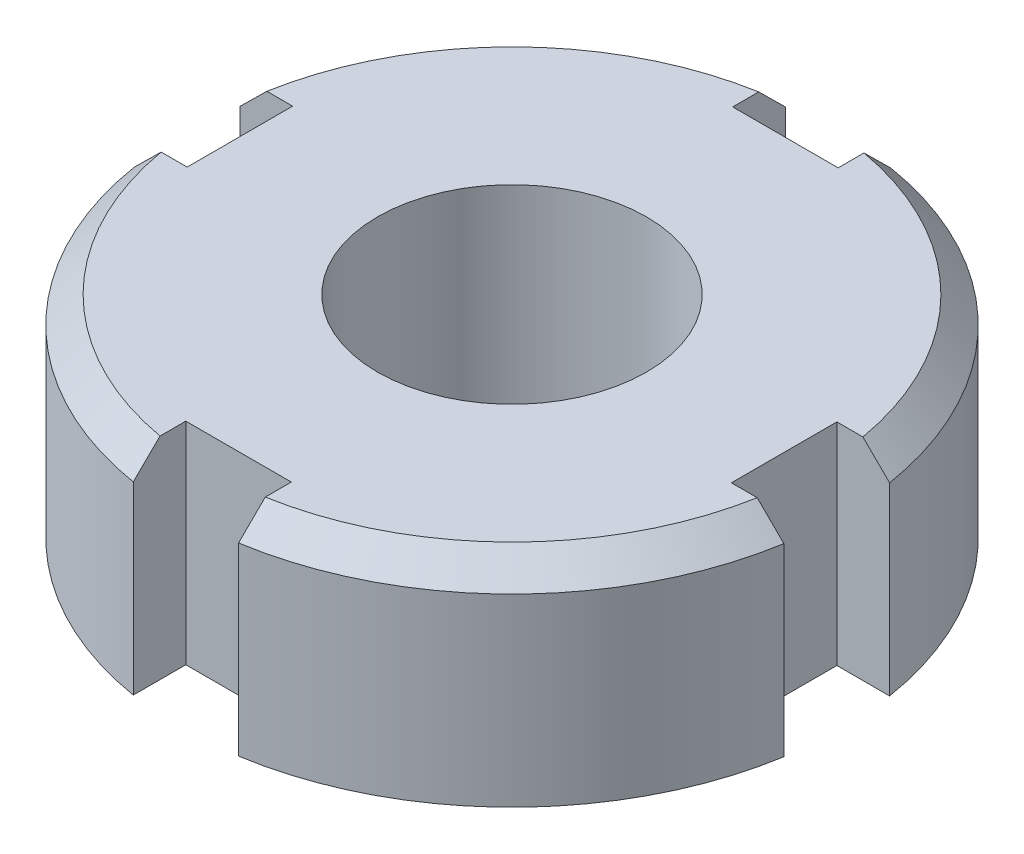
ISO-10303-21;
HEADER;
FILE_DESCRIPTION(('STEP AP214'),'2;1');
FILE_NAME('part.step','',(''),(''),'','','');
FILE_SCHEMA(('AUTOMOTIVE_DESIGN { 1 0 10303 214 1 1 1 1 }'));
ENDSEC;
DATA;
#1=APPLICATION_CONTEXT('core data for automotive mechanical design processes');
#2=APPLICATION_PROTOCOL_DEFINITION('international standard','automotive_design',2000,#1);
#3=PRODUCT_CONTEXT('',#1,'mechanical');
#4=PRODUCT('Part','Part','',(#3));
#5=PRODUCT_RELATED_PRODUCT_CATEGORY('part','',(#4));
#6=PRODUCT_DEFINITION_FORMATION('','',#4);
#7=PRODUCT_DEFINITION_CONTEXT('part definition',#1,'design');
#8=PRODUCT_DEFINITION('design','',#6,#7);
#9=PRODUCT_DEFINITION_SHAPE('','',#8);
#10=(LENGTH_UNIT() NAMED_UNIT(*) SI_UNIT(.MILLI.,.METRE.));
#11=(NAMED_UNIT(*) PLANE_ANGLE_UNIT() SI_UNIT($,.RADIAN.));
#12=(NAMED_UNIT(*) SI_UNIT($,.STERADIAN.) SOLID_ANGLE_UNIT());
#13=UNCERTAINTY_MEASURE_WITH_UNIT(LENGTH_MEASURE(1.E-05),#10,'distance_accuracy_value','');
#14=(GEOMETRIC_REPRESENTATION_CONTEXT(3) GLOBAL_UNCERTAINTY_ASSIGNED_CONTEXT((#13)) GLOBAL_UNIT_ASSIGNED_CONTEXT((#10,
#11,#12)) REPRESENTATION_CONTEXT('',''));
#15=CARTESIAN_POINT('',(0.,0.,0.));
#16=DIRECTION('',(0.,0.,1.));
#17=DIRECTION('',(1.,0.,0.));
#18=AXIS2_PLACEMENT_3D('',#15,#16,#17);
#19=CARTESIAN_POINT('',(0.,4.,0.));
#20=DIRECTION('',(0.,-1.,0.));
#21=DIRECTION('',(0.,0.,-1.));
#22=AXIS2_PLACEMENT_3D('',#19,#20,#21);
#23=CYLINDRICAL_SURFACE('',#22,12.5);
#24=DIRECTION('',(0.,1.,0.));
#25=VECTOR('',#24,1.);
#26=CARTESIAN_POINT('',(12.3348649811997,-4.,2.02511873616663));
#27=LINE('',#26,#25);
#28=CARTESIAN_POINT('',(12.3348649811997,-4.,2.02511873616663));
#29=VERTEX_POINT('',#28);
#30=CARTESIAN_POINT('',(12.3348649811997,3.00000000000001,2.02511873616663));
#31=VERTEX_POINT('',#30);
#32=EDGE_CURVE('E224',#29,#31,#27,.T.);
#33=ORIENTED_EDGE('',*,*,#32,.T.);
#34=CARTESIAN_POINT('',(0.,3.00000000000001,0.));
#35=DIRECTION('',(0.,1.,0.));
#36=DIRECTION('',(0.,0.,1.));
#37=AXIS2_PLACEMENT_3D('',#34,#35,#36);
#38=CIRCLE('',#37,12.5);
#39=CARTESIAN_POINT('',(1.97488126383332,3.00000000000001,12.3430078989588));
#40=VERTEX_POINT('',#39);
#41=EDGE_CURVE('E61',#31,#40,#38,.F.);
#42=ORIENTED_EDGE('',*,*,#41,.T.);
#43=DIRECTION('',(0.,1.,0.));
#44=VECTOR('',#43,1.);
#45=CARTESIAN_POINT('',(1.97488126383332,-4.,12.3430078989588));
#46=LINE('',#45,#44);
#47=CARTESIAN_POINT('',(1.97488126383332,-4.,12.3430078989588));
#48=VERTEX_POINT('',#47);
#49=EDGE_CURVE('E252',#48,#40,#46,.T.);
#50=ORIENTED_EDGE('',*,*,#49,.F.);
#51=CARTESIAN_POINT('',(0.,-4.,0.));
#52=DIRECTION('',(0.,1.,0.));
#53=DIRECTION('',(0.,0.,1.));
#54=AXIS2_PLACEMENT_3D('',#51,#52,#53);
#55=CIRCLE('',#54,12.5);
#56=EDGE_CURVE('E310',#48,#29,#55,.T.);
#57=ORIENTED_EDGE('',*,*,#56,.T.);
#58=EDGE_LOOP('',(#33,#42,#50,#57));
#59=FACE_BOUND('',#58,.T.);
#60=ADVANCED_FACE('F46',(#59),#23,.T.);
#61=DIRECTION('',(0.,1.,0.));
#62=VECTOR('',#61,1.);
#63=CARTESIAN_POINT('',(-2.02511873616668,-4.,12.3348649811997));
#64=LINE('',#63,#62);
#65=CARTESIAN_POINT('',(-2.02511873616668,-4.,12.3348649811997));
#66=VERTEX_POINT('',#65);
#67=CARTESIAN_POINT('',(-2.02511873616668,3.,12.3348649811997));
#68=VERTEX_POINT('',#67);
#69=EDGE_CURVE('E245',#66,#68,#64,.T.);
#70=ORIENTED_EDGE('',*,*,#69,.T.);
#71=CARTESIAN_POINT('',(0.,3.,0.));
#72=DIRECTION('',(0.,1.,0.));
#73=DIRECTION('',(0.,0.,1.));
#74=AXIS2_PLACEMENT_3D('',#71,#72,#73);
#75=CIRCLE('',#74,12.5);
#76=CARTESIAN_POINT('',(-12.3430078989588,3.,1.97488126383328));
#77=VERTEX_POINT('',#76);
#78=EDGE_CURVE('E389',#68,#77,#75,.F.);
#79=ORIENTED_EDGE('',*,*,#78,.T.);
#80=DIRECTION('',(0.,1.,0.));
#81=VECTOR('',#80,1.);
#82=CARTESIAN_POINT('',(-12.3430078989588,-4.,1.97488126383328));
#83=LINE('',#82,#81);
#84=CARTESIAN_POINT('',(-12.3430078989588,-4.,1.97488126383328));
#85=VERTEX_POINT('',#84);
#86=EDGE_CURVE('E305',#85,#77,#83,.T.);
#87=ORIENTED_EDGE('',*,*,#86,.F.);
#88=EDGE_CURVE('E225',#85,#66,#55,.T.);
#89=ORIENTED_EDGE('',*,*,#88,.T.);
#90=EDGE_LOOP('',(#70,#79,#87,#89));
#91=FACE_BOUND('',#90,.T.);
#92=ADVANCED_FACE('F415',(#91),#23,.T.);
#93=DIRECTION('',(0.,1.,0.));
#94=VECTOR('',#93,1.);
#95=CARTESIAN_POINT('',(2.02511873616659,-4.,-12.3348649811997));
#96=LINE('',#95,#94);
#97=CARTESIAN_POINT('',(2.02511873616659,-4.,-12.3348649811997));
#98=VERTEX_POINT('',#97);
#99=CARTESIAN_POINT('',(2.02511873616659,2.99999999999999,-12.3348649811997));
#100=VERTEX_POINT('',#99);
#101=EDGE_CURVE('E272',#98,#100,#96,.T.);
#102=ORIENTED_EDGE('',*,*,#101,.T.);
#103=CARTESIAN_POINT('',(0.,2.99999999999999,0.));
#104=DIRECTION('',(0.,1.,0.));
#105=DIRECTION('',(0.,0.,1.));
#106=AXIS2_PLACEMENT_3D('',#103,#104,#105);
#107=CIRCLE('',#106,12.5);
#108=CARTESIAN_POINT('',(12.3430078989588,2.99999999999999,-1.97488126383337));
#109=VERTEX_POINT('',#108);
#110=EDGE_CURVE('E332',#100,#109,#107,.F.);
#111=ORIENTED_EDGE('',*,*,#110,.T.);
#112=DIRECTION('',(0.,1.,0.));
#113=VECTOR('',#112,1.);
#114=CARTESIAN_POINT('',(12.3430078989588,-4.,-1.97488126383337));
#115=LINE('',#114,#113);
#116=CARTESIAN_POINT('',(12.3430078989588,-4.,-1.97488126383337));
#117=VERTEX_POINT('',#116);
#118=EDGE_CURVE('E211',#117,#109,#115,.T.);
#119=ORIENTED_EDGE('',*,*,#118,.F.);
#120=EDGE_CURVE('E314',#117,#98,#55,.T.);
#121=ORIENTED_EDGE('',*,*,#120,.T.);
#122=EDGE_LOOP('',(#102,#111,#119,#121));
#123=FACE_BOUND('',#122,.T.);
#124=ADVANCED_FACE('F419',(#123),#23,.T.);
#125=DIRECTION('',(0.,1.,0.));
#126=VECTOR('',#125,1.);
#127=CARTESIAN_POINT('',(-12.3348649811997,-4.,-2.02511873616672));
#128=LINE('',#127,#126);
#129=CARTESIAN_POINT('',(-12.3348649811997,-4.,-2.02511873616672));
#130=VERTEX_POINT('',#129);
#131=CARTESIAN_POINT('',(-12.3348649811997,3.,-2.02511873616672));
#132=VERTEX_POINT('',#131);
#133=EDGE_CURVE('E299',#130,#132,#128,.T.);
#134=ORIENTED_EDGE('',*,*,#133,.T.);
#135=CARTESIAN_POINT('',(0.,3.,0.));
#136=DIRECTION('',(0.,1.,0.));
#137=DIRECTION('',(0.,0.,1.));
#138=AXIS2_PLACEMENT_3D('',#135,#136,#137);
#139=CIRCLE('',#138,12.5);
#140=CARTESIAN_POINT('',(-1.97488126383341,3.,-12.3430078989588));
#141=VERTEX_POINT('',#140);
#142=EDGE_CURVE('E430',#132,#141,#139,.F.);
#143=ORIENTED_EDGE('',*,*,#142,.T.);
#144=DIRECTION('',(0.,1.,0.));
#145=VECTOR('',#144,1.);
#146=CARTESIAN_POINT('',(-1.97488126383341,-4.,-12.3430078989588));
#147=LINE('',#146,#145);
#148=CARTESIAN_POINT('',(-1.97488126383341,-4.,-12.3430078989588));
#149=VERTEX_POINT('',#148);
#150=EDGE_CURVE('E278',#149,#141,#147,.T.);
#151=ORIENTED_EDGE('',*,*,#150,.F.);
#152=EDGE_CURVE('E432',#149,#130,#55,.T.);
#153=ORIENTED_EDGE('',*,*,#152,.T.);
#154=EDGE_LOOP('',(#134,#143,#151,#153));
#155=FACE_BOUND('',#154,.T.);
#156=ADVANCED_FACE('F406',(#155),#23,.T.);
#157=CARTESIAN_POINT('',(0.,4.,0.));
#158=DIRECTION('',(0.,1.,0.));
#159=DIRECTION('',(0.,0.,1.));
#160=AXIS2_PLACEMENT_3D('',#157,#158,#159);
#161=PLANE('',#160);
#162=CARTESIAN_POINT('',(0.,4.,0.));
#163=DIRECTION('',(0.,1.,0.));
#164=DIRECTION('',(0.,0.,1.));
#165=AXIS2_PLACEMENT_3D('',#162,#163,#164);
#166=CIRCLE('',#165,5.1);
#167=CARTESIAN_POINT('',(0.,4.,5.1));
#168=VERTEX_POINT('',#167);
#169=EDGE_CURVE('E475',#168,#168,#166,.T.);
#170=ORIENTED_EDGE('',*,*,#169,.F.);
#171=EDGE_LOOP('',(#170));
#172=FACE_BOUND('',#171,.T.);
#173=DIRECTION('',(-1.,0.,0.));
#174=VECTOR('',#173,1.);
#175=CARTESIAN_POINT('',(0.,4.,-1.97488126383341));
#176=LINE('',#175,#174);
#177=CARTESIAN_POINT('',(11.3291590152915,4.,-1.97488126383337));
#178=VERTEX_POINT('',#177);
#179=CARTESIAN_POINT('',(10.3430078989588,4.,-1.97488126383338));
#180=VERTEX_POINT('',#179);
#181=EDGE_CURVE('E188',#178,#180,#176,.T.);
#182=ORIENTED_EDGE('',*,*,#181,.F.);
#183=CARTESIAN_POINT('',(0.,4.,0.));
#184=DIRECTION('',(0.,1.,0.));
#185=DIRECTION('',(0.,0.,1.));
#186=AXIS2_PLACEMENT_3D('',#183,#184,#185);
#187=CIRCLE('',#186,11.5);
#188=CARTESIAN_POINT('',(2.02511873616659,4.,-11.3202868384342));
#189=VERTEX_POINT('',#188);
#190=EDGE_CURVE('E322',#178,#189,#187,.T.);
#191=ORIENTED_EDGE('',*,*,#190,.T.);
#192=DIRECTION('',(0.,0.,1.));
#193=VECTOR('',#192,1.);
#194=CARTESIAN_POINT('',(2.02511873616659,4.,0.));
#195=LINE('',#194,#193);
#196=CARTESIAN_POINT('',(2.02511873616659,4.,-10.3430078989588));
#197=VERTEX_POINT('',#196);
#198=EDGE_CURVE('E256',#189,#197,#195,.T.);
#199=ORIENTED_EDGE('',*,*,#198,.T.);
#200=DIRECTION('',(-1.,0.,0.));
#201=VECTOR('',#200,1.);
#202=CARTESIAN_POINT('',(0.,4.,-10.3430078989588));
#203=LINE('',#202,#201);
#204=CARTESIAN_POINT('',(-1.97488126383341,4.,-10.3430078989588));
#205=VERTEX_POINT('',#204);
#206=EDGE_CURVE('E261',#197,#205,#203,.T.);
#207=ORIENTED_EDGE('',*,*,#206,.T.);
#208=DIRECTION('',(0.,0.,1.));
#209=VECTOR('',#208,1.);
#210=CARTESIAN_POINT('',(-1.97488126383341,4.,0.));
#211=LINE('',#210,#209);
#212=CARTESIAN_POINT('',(-1.97488126383341,4.,-11.3291590152915));
#213=VERTEX_POINT('',#212);
#214=EDGE_CURVE('E258',#213,#205,#211,.T.);
#215=ORIENTED_EDGE('',*,*,#214,.F.);
#216=CARTESIAN_POINT('',(0.,4.,0.));
#217=DIRECTION('',(0.,1.,0.));
#218=DIRECTION('',(0.,0.,1.));
#219=AXIS2_PLACEMENT_3D('',#216,#217,#218);
#220=CIRCLE('',#219,11.5);
#221=CARTESIAN_POINT('',(-11.3202868384342,4.,-2.02511873616671));
#222=VERTEX_POINT('',#221);
#223=EDGE_CURVE('E319',#213,#222,#220,.T.);
#224=ORIENTED_EDGE('',*,*,#223,.T.);
#225=DIRECTION('',(1.,0.,0.));
#226=VECTOR('',#225,1.);
#227=CARTESIAN_POINT('',(0.,4.,-2.02511873616659));
#228=LINE('',#227,#226);
#229=CARTESIAN_POINT('',(-10.3430078989588,4.,-2.0251187361667));
#230=VERTEX_POINT('',#229);
#231=EDGE_CURVE('E283',#222,#230,#228,.T.);
#232=ORIENTED_EDGE('',*,*,#231,.T.);
#233=DIRECTION('',(0.,0.,1.));
#234=VECTOR('',#233,1.);
#235=CARTESIAN_POINT('',(-10.3430078989588,4.,-1.07653551687224E-13));
#236=LINE('',#235,#234);
#237=CARTESIAN_POINT('',(-10.3430078989588,4.,1.9748812638333));
#238=VERTEX_POINT('',#237);
#239=EDGE_CURVE('E288',#230,#238,#236,.T.);
#240=ORIENTED_EDGE('',*,*,#239,.T.);
#241=DIRECTION('',(1.,0.,0.));
#242=VECTOR('',#241,1.);
#243=CARTESIAN_POINT('',(0.,4.,1.97488126383341));
#244=LINE('',#243,#242);
#245=CARTESIAN_POINT('',(-11.3291590152915,4.,1.97488126383329));
#246=VERTEX_POINT('',#245);
#247=EDGE_CURVE('E285',#246,#238,#244,.T.);
#248=ORIENTED_EDGE('',*,*,#247,.F.);
#249=CARTESIAN_POINT('',(0.,4.,0.));
#250=DIRECTION('',(0.,1.,0.));
#251=DIRECTION('',(0.,0.,1.));
#252=AXIS2_PLACEMENT_3D('',#249,#250,#251);
#253=CIRCLE('',#252,11.5);
#254=CARTESIAN_POINT('',(-2.02511873616667,4.,11.3202868384342));
#255=VERTEX_POINT('',#254);
#256=EDGE_CURVE('E316',#246,#255,#253,.T.);
#257=ORIENTED_EDGE('',*,*,#256,.T.);
#258=DIRECTION('',(0.,0.,-1.));
#259=VECTOR('',#258,1.);
#260=CARTESIAN_POINT('',(-2.02511873616659,4.,0.));
#261=LINE('',#260,#259);
#262=CARTESIAN_POINT('',(-2.02511873616666,4.,10.3430078989588));
#263=VERTEX_POINT('',#262);
#264=EDGE_CURVE('E229',#255,#263,#261,.T.);
#265=ORIENTED_EDGE('',*,*,#264,.T.);
#266=DIRECTION('',(1.,0.,0.));
#267=VECTOR('',#266,1.);
#268=CARTESIAN_POINT('',(0.,4.,10.3430078989588));
#269=LINE('',#268,#267);
#270=CARTESIAN_POINT('',(1.97488126383334,4.,10.3430078989588));
#271=VERTEX_POINT('',#270);
#272=EDGE_CURVE('E234',#263,#271,#269,.T.);
#273=ORIENTED_EDGE('',*,*,#272,.T.);
#274=DIRECTION('',(0.,0.,-1.));
#275=VECTOR('',#274,1.);
#276=CARTESIAN_POINT('',(1.97488126383341,4.,0.));
#277=LINE('',#276,#275);
#278=CARTESIAN_POINT('',(1.97488126383333,4.,11.3291590152915));
#279=VERTEX_POINT('',#278);
#280=EDGE_CURVE('E231',#279,#271,#277,.T.);
#281=ORIENTED_EDGE('',*,*,#280,.F.);
#282=CARTESIAN_POINT('',(0.,4.,0.));
#283=DIRECTION('',(0.,1.,0.));
#284=DIRECTION('',(0.,0.,1.));
#285=AXIS2_PLACEMENT_3D('',#282,#283,#284);
#286=CIRCLE('',#285,11.5);
#287=CARTESIAN_POINT('',(11.3202868384342,4.,2.02511873616663));
#288=VERTEX_POINT('',#287);
#289=EDGE_CURVE('E313',#279,#288,#286,.T.);
#290=ORIENTED_EDGE('',*,*,#289,.T.);
#291=DIRECTION('',(-1.,0.,0.));
#292=VECTOR('',#291,1.);
#293=CARTESIAN_POINT('',(0.,4.,2.02511873616659));
#294=LINE('',#293,#292);
#295=CARTESIAN_POINT('',(10.3430078989588,4.,2.02511873616662));
#296=VERTEX_POINT('',#295);
#297=EDGE_CURVE('E201',#288,#296,#294,.T.);
#298=ORIENTED_EDGE('',*,*,#297,.T.);
#299=DIRECTION('',(0.,0.,-1.));
#300=VECTOR('',#299,1.);
#301=CARTESIAN_POINT('',(10.3430078989588,4.,0.));
#302=LINE('',#301,#300);
#303=EDGE_CURVE('E200',#296,#180,#302,.T.);
#304=ORIENTED_EDGE('',*,*,#303,.T.);
#305=EDGE_LOOP('',(#182,#191,#199,#207,#215,#224,#232,#240,#248,#257,#265,#273,#281,#290,#298,#304));
#306=FACE_BOUND('',#305,.T.);
#307=ADVANCED_FACE('F213',(#172,#306),#161,.T.);
#308=CARTESIAN_POINT('',(0.,-4.,0.));
#309=DIRECTION('',(0.,1.,0.));
#310=DIRECTION('',(0.,0.,1.));
#311=AXIS2_PLACEMENT_3D('',#308,#309,#310);
#312=PLANE('',#311);
#313=CARTESIAN_POINT('',(0.,-4.,0.));
#314=DIRECTION('',(0.,1.,0.));
#315=DIRECTION('',(0.,0.,1.));
#316=AXIS2_PLACEMENT_3D('',#313,#314,#315);
#317=CIRCLE('',#316,5.1);
#318=CARTESIAN_POINT('',(0.,-4.,5.1));
#319=VERTEX_POINT('',#318);
#320=EDGE_CURVE('E286',#319,#319,#317,.T.);
#321=ORIENTED_EDGE('',*,*,#320,.T.);
#322=EDGE_LOOP('',(#321));
#323=FACE_BOUND('',#322,.T.);
#324=DIRECTION('',(-1.,0.,0.));
#325=VECTOR('',#324,1.);
#326=CARTESIAN_POINT('',(0.,-4.,2.02511873616659));
#327=LINE('',#326,#325);
#328=CARTESIAN_POINT('',(10.3430078989588,-4.,2.02511873616662));
#329=VERTEX_POINT('',#328);
#330=EDGE_CURVE('E216',#29,#329,#327,.T.);
#331=ORIENTED_EDGE('',*,*,#330,.F.);
#332=ORIENTED_EDGE('',*,*,#56,.F.);
#333=DIRECTION('',(0.,0.,-1.));
#334=VECTOR('',#333,1.);
#335=CARTESIAN_POINT('',(1.97488126383341,-4.,0.));
#336=LINE('',#335,#334);
#337=CARTESIAN_POINT('',(1.97488126383334,-4.,10.3430078989588));
#338=VERTEX_POINT('',#337);
#339=EDGE_CURVE('E239',#48,#338,#336,.T.);
#340=ORIENTED_EDGE('',*,*,#339,.T.);
#341=DIRECTION('',(1.,0.,0.));
#342=VECTOR('',#341,1.);
#343=CARTESIAN_POINT('',(0.,-4.,10.3430078989588));
#344=LINE('',#343,#342);
#345=CARTESIAN_POINT('',(-2.02511873616666,-4.,10.3430078989588));
#346=VERTEX_POINT('',#345);
#347=EDGE_CURVE('E242',#346,#338,#344,.T.);
#348=ORIENTED_EDGE('',*,*,#347,.F.);
#349=DIRECTION('',(0.,0.,-1.));
#350=VECTOR('',#349,1.);
#351=CARTESIAN_POINT('',(-2.02511873616659,-4.,0.));
#352=LINE('',#351,#350);
#353=EDGE_CURVE('E237',#66,#346,#352,.T.);
#354=ORIENTED_EDGE('',*,*,#353,.F.);
#355=ORIENTED_EDGE('',*,*,#88,.F.);
#356=DIRECTION('',(1.,0.,0.));
#357=VECTOR('',#356,1.);
#358=CARTESIAN_POINT('',(0.,-4.,1.97488126383341));
#359=LINE('',#358,#357);
#360=CARTESIAN_POINT('',(-10.3430078989588,-4.,1.9748812638333));
#361=VERTEX_POINT('',#360);
#362=EDGE_CURVE('E293',#85,#361,#359,.T.);
#363=ORIENTED_EDGE('',*,*,#362,.T.);
#364=DIRECTION('',(0.,0.,1.));
#365=VECTOR('',#364,1.);
#366=CARTESIAN_POINT('',(-10.3430078989588,-4.,-1.07653551687224E-13));
#367=LINE('',#366,#365);
#368=CARTESIAN_POINT('',(-10.3430078989588,-4.,-2.0251187361667));
#369=VERTEX_POINT('',#368);
#370=EDGE_CURVE('E296',#369,#361,#367,.T.);
#371=ORIENTED_EDGE('',*,*,#370,.F.);
#372=DIRECTION('',(1.,0.,0.));
#373=VECTOR('',#372,1.);
#374=CARTESIAN_POINT('',(0.,-4.,-2.02511873616659));
#375=LINE('',#374,#373);
#376=EDGE_CURVE('E291',#130,#369,#375,.T.);
#377=ORIENTED_EDGE('',*,*,#376,.F.);
#378=ORIENTED_EDGE('',*,*,#152,.F.);
#379=DIRECTION('',(0.,0.,1.));
#380=VECTOR('',#379,1.);
#381=CARTESIAN_POINT('',(-1.97488126383341,-4.,0.));
#382=LINE('',#381,#380);
#383=CARTESIAN_POINT('',(-1.97488126383341,-4.,-10.3430078989588));
#384=VERTEX_POINT('',#383);
#385=EDGE_CURVE('E266',#149,#384,#382,.T.);
#386=ORIENTED_EDGE('',*,*,#385,.T.);
#387=DIRECTION('',(-1.,0.,0.));
#388=VECTOR('',#387,1.);
#389=CARTESIAN_POINT('',(0.,-4.,-10.3430078989588));
#390=LINE('',#389,#388);
#391=CARTESIAN_POINT('',(2.02511873616659,-4.,-10.3430078989588));
#392=VERTEX_POINT('',#391);
#393=EDGE_CURVE('E269',#392,#384,#390,.T.);
#394=ORIENTED_EDGE('',*,*,#393,.F.);
#395=DIRECTION('',(0.,0.,1.));
#396=VECTOR('',#395,1.);
#397=CARTESIAN_POINT('',(2.02511873616659,-4.,0.));
#398=LINE('',#397,#396);
#399=EDGE_CURVE('E264',#98,#392,#398,.T.);
#400=ORIENTED_EDGE('',*,*,#399,.F.);
#401=ORIENTED_EDGE('',*,*,#120,.F.);
#402=DIRECTION('',(-1.,0.,0.));
#403=VECTOR('',#402,1.);
#404=CARTESIAN_POINT('',(0.,-4.,-1.97488126383341));
#405=LINE('',#404,#403);
#406=CARTESIAN_POINT('',(10.3430078989588,-4.,-1.97488126383338));
#407=VERTEX_POINT('',#406);
#408=EDGE_CURVE('E218',#117,#407,#405,.T.);
#409=ORIENTED_EDGE('',*,*,#408,.T.);
#410=DIRECTION('',(0.,0.,-1.));
#411=VECTOR('',#410,1.);
#412=CARTESIAN_POINT('',(10.3430078989588,-4.,0.));
#413=LINE('',#412,#411);
#414=EDGE_CURVE('E208',#329,#407,#413,.T.);
#415=ORIENTED_EDGE('',*,*,#414,.F.);
#416=EDGE_LOOP('',(#331,#332,#340,#348,#354,#355,#363,#371,#377,#378,#386,#394,#400,#401,#409,#415));
#417=FACE_BOUND('',#416,.T.);
#418=ADVANCED_FACE('F403',(#323,#417),#312,.F.);
#419=CARTESIAN_POINT('',(0.,-4.,-2.02511873616659));
#420=DIRECTION('',(0.,0.,1.));
#421=DIRECTION('',(1.,0.,0.));
#422=AXIS2_PLACEMENT_3D('',#419,#420,#421);
#423=PLANE('',#422);
#424=ORIENTED_EDGE('',*,*,#231,.F.);
#425=CARTESIAN_POINT('',(-11.3202868384342,4.,-2.02511873616671));
#426=CARTESIAN_POINT('',(-11.4894851605881,3.83343678350164,-2.02511873616671));
#427=CARTESIAN_POINT('',(-11.6586325005583,3.66682184159401,-2.02511873616671));
#428=CARTESIAN_POINT('',(-11.9968252148126,3.33348850825987,-2.02511873616672));
#429=CARTESIAN_POINT('',(-12.1658705890976,3.16677011683416,-2.02511873616672));
#430=CARTESIAN_POINT('',(-12.3348649811997,3.,-2.02511873616672));
#431=B_SPLINE_CURVE_WITH_KNOTS('',3,(#425,#426,#427,#428,#429,#430),.UNSPECIFIED.,.F.,.F.,(4,2,
4),(0.,0.712279617406539,1.4245592292589),.UNSPECIFIED.);
#432=EDGE_CURVE('E358',#222,#132,#431,.T.);
#433=ORIENTED_EDGE('',*,*,#432,.T.);
#434=ORIENTED_EDGE('',*,*,#133,.F.);
#435=ORIENTED_EDGE('',*,*,#376,.T.);
#436=DIRECTION('',(0.,1.,0.));
#437=VECTOR('',#436,1.);
#438=CARTESIAN_POINT('',(-10.3430078989588,-4.,-2.0251187361667));
#439=LINE('',#438,#437);
#440=EDGE_CURVE('E259',#369,#230,#439,.T.);
#441=ORIENTED_EDGE('',*,*,#440,.T.);
#442=EDGE_LOOP('',(#424,#433,#434,#435,#441));
#443=FACE_BOUND('',#442,.T.);
#444=ADVANCED_FACE('F399',(#443),#423,.T.);
#445=CARTESIAN_POINT('',(-10.3430078989588,-4.,-1.07653551687224E-13));
#446=DIRECTION('',(-1.,0.,0.));
#447=DIRECTION('',(0.,0.,1.));
#448=AXIS2_PLACEMENT_3D('',#445,#446,#447);
#449=PLANE('',#448);
#450=ORIENTED_EDGE('',*,*,#440,.F.);
#451=ORIENTED_EDGE('',*,*,#370,.T.);
#452=DIRECTION('',(0.,1.,0.));
#453=VECTOR('',#452,1.);
#454=CARTESIAN_POINT('',(-10.3430078989588,-4.,1.9748812638333));
#455=LINE('',#454,#453);
#456=EDGE_CURVE('E302',#361,#238,#455,.T.);
#457=ORIENTED_EDGE('',*,*,#456,.T.);
#458=ORIENTED_EDGE('',*,*,#239,.F.);
#459=EDGE_LOOP('',(#450,#451,#457,#458));
#460=FACE_BOUND('',#459,.T.);
#461=ADVANCED_FACE('F397',(#460),#449,.T.);
#462=CARTESIAN_POINT('',(0.,-4.,1.97488126383341));
#463=DIRECTION('',(0.,0.,1.));
#464=DIRECTION('',(1.,0.,0.));
#465=AXIS2_PLACEMENT_3D('',#462,#463,#464);
#466=PLANE('',#465);
#467=ORIENTED_EDGE('',*,*,#86,.T.);
#468=CARTESIAN_POINT('',(-12.3430078989588,3.,1.97488126383328));
#469=CARTESIAN_POINT('',(-12.1741299152117,3.16676483666583,1.97488126383328));
#470=CARTESIAN_POINT('',(-12.005203516663,3.33348058803925,1.97488126383328));
#471=CARTESIAN_POINT('',(-11.6672538887746,3.66681392137327,1.97488126383329));
#472=CARTESIAN_POINT('',(-11.4982306594341,3.83343150333319,1.97488126383329));
#473=CARTESIAN_POINT('',(-11.3291590152915,4.,1.97488126383329));
#474=B_SPLINE_CURVE_WITH_KNOTS('',3,(#468,#469,#470,#471,#472,#473),.UNSPECIFIED.,.F.,.F.,(4,2,
4),(0.,0.712019963865836,1.4240399327387),.UNSPECIFIED.);
#475=EDGE_CURVE('E382',#77,#246,#474,.T.);
#476=ORIENTED_EDGE('',*,*,#475,.T.);
#477=ORIENTED_EDGE('',*,*,#247,.T.);
#478=ORIENTED_EDGE('',*,*,#456,.F.);
#479=ORIENTED_EDGE('',*,*,#362,.F.);
#480=EDGE_LOOP('',(#467,#476,#477,#478,#479));
#481=FACE_BOUND('',#480,.T.);
#482=ADVANCED_FACE('F394',(#481),#466,.F.);
#483=CARTESIAN_POINT('',(2.02511873616659,-4.,0.));
#484=DIRECTION('',(-1.,0.,0.));
#485=DIRECTION('',(0.,0.,1.));
#486=AXIS2_PLACEMENT_3D('',#483,#484,#485);
#487=PLANE('',#486);
#488=ORIENTED_EDGE('',*,*,#198,.F.);
#489=CARTESIAN_POINT('',(2.02511873616659,4.,-11.3202868384342));
#490=CARTESIAN_POINT('',(2.02511873616659,3.83343678350163,-11.4894851605881));
#491=CARTESIAN_POINT('',(2.02511873616659,3.66682184159401,-11.6586325005583));
#492=CARTESIAN_POINT('',(2.02511873616659,3.33348850825987,-11.9968252148126));
#493=CARTESIAN_POINT('',(2.02511873616659,3.16677011683416,-12.1658705890976));
#494=CARTESIAN_POINT('',(2.02511873616659,2.99999999999999,-12.3348649811997));
#495=B_SPLINE_CURVE_WITH_KNOTS('',3,(#489,#490,#491,#492,#493,#494),.UNSPECIFIED.,.F.,.F.,(4,2,
4),(0.,0.712279617406542,1.42455922925891),.UNSPECIFIED.);
#496=EDGE_CURVE('E324',#189,#100,#495,.T.);
#497=ORIENTED_EDGE('',*,*,#496,.T.);
#498=ORIENTED_EDGE('',*,*,#101,.F.);
#499=ORIENTED_EDGE('',*,*,#399,.T.);
#500=DIRECTION('',(0.,1.,0.));
#501=VECTOR('',#500,1.);
#502=CARTESIAN_POINT('',(2.02511873616659,-4.,-10.3430078989588));
#503=LINE('',#502,#501);
#504=EDGE_CURVE('E232',#392,#197,#503,.T.);
#505=ORIENTED_EDGE('',*,*,#504,.T.);
#506=EDGE_LOOP('',(#488,#497,#498,#499,#505));
#507=FACE_BOUND('',#506,.T.);
#508=ADVANCED_FACE('F334',(#507),#487,.T.);
#509=CARTESIAN_POINT('',(0.,-4.,-10.3430078989588));
#510=DIRECTION('',(0.,0.,-1.));
#511=DIRECTION('',(-1.,0.,0.));
#512=AXIS2_PLACEMENT_3D('',#509,#510,#511);
#513=PLANE('',#512);
#514=ORIENTED_EDGE('',*,*,#504,.F.);
#515=ORIENTED_EDGE('',*,*,#393,.T.);
#516=DIRECTION('',(0.,1.,0.));
#517=VECTOR('',#516,1.);
#518=CARTESIAN_POINT('',(-1.97488126383341,-4.,-10.3430078989588));
#519=LINE('',#518,#517);
#520=EDGE_CURVE('E275',#384,#205,#519,.T.);
#521=ORIENTED_EDGE('',*,*,#520,.T.);
#522=ORIENTED_EDGE('',*,*,#206,.F.);
#523=EDGE_LOOP('',(#514,#515,#521,#522));
#524=FACE_BOUND('',#523,.T.);
#525=ADVANCED_FACE('F454',(#524),#513,.T.);
#526=CARTESIAN_POINT('',(-1.97488126383341,-4.,0.));
#527=DIRECTION('',(-1.,0.,0.));
#528=DIRECTION('',(0.,0.,1.));
#529=AXIS2_PLACEMENT_3D('',#526,#527,#528);
#530=PLANE('',#529);
#531=ORIENTED_EDGE('',*,*,#150,.T.);
#532=CARTESIAN_POINT('',(-1.97488126383341,3.,-12.3430078989588));
#533=CARTESIAN_POINT('',(-1.97488126383341,3.16676483666583,-12.1741299152117));
#534=CARTESIAN_POINT('',(-1.97488126383341,3.33348058803925,-12.005203516663));
#535=CARTESIAN_POINT('',(-1.97488126383341,3.66681392137327,-11.6672538887746));
#536=CARTESIAN_POINT('',(-1.97488126383341,3.83343150333319,-11.4982306594341));
#537=CARTESIAN_POINT('',(-1.97488126383341,4.,-11.3291590152915));
#538=B_SPLINE_CURVE_WITH_KNOTS('',3,(#532,#533,#534,#535,#536,#537),.UNSPECIFIED.,.F.,.F.,(4,2,
4),(0.,0.712019963865841,1.42403993273871),.UNSPECIFIED.);
#539=EDGE_CURVE('E437',#141,#213,#538,.T.);
#540=ORIENTED_EDGE('',*,*,#539,.T.);
#541=ORIENTED_EDGE('',*,*,#214,.T.);
#542=ORIENTED_EDGE('',*,*,#520,.F.);
#543=ORIENTED_EDGE('',*,*,#385,.F.);
#544=EDGE_LOOP('',(#531,#540,#541,#542,#543));
#545=FACE_BOUND('',#544,.T.);
#546=ADVANCED_FACE('F449',(#545),#530,.F.);
#547=CARTESIAN_POINT('',(-2.02511873616659,-4.,0.));
#548=DIRECTION('',(1.,0.,0.));
#549=DIRECTION('',(0.,0.,-1.));
#550=AXIS2_PLACEMENT_3D('',#547,#548,#549);
#551=PLANE('',#550);
#552=ORIENTED_EDGE('',*,*,#264,.F.);
#553=CARTESIAN_POINT('',(-2.02511873616667,4.,11.3202868384342));
#554=CARTESIAN_POINT('',(-2.02511873616667,3.83343678350164,11.4894851605881));
#555=CARTESIAN_POINT('',(-2.02511873616667,3.66682184159401,11.6586325005583));
#556=CARTESIAN_POINT('',(-2.02511873616667,3.33348850825988,11.9968252148126));
#557=CARTESIAN_POINT('',(-2.02511873616667,3.16677011683417,12.1658705890976));
#558=CARTESIAN_POINT('',(-2.02511873616668,3.,12.3348649811997));
#559=B_SPLINE_CURVE_WITH_KNOTS('',3,(#553,#554,#555,#556,#557,#558),.UNSPECIFIED.,.F.,.F.,(4,2,
4),(0.,0.712279617406534,1.42455922925889),.UNSPECIFIED.);
#560=EDGE_CURVE('E438',#255,#68,#559,.T.);
#561=ORIENTED_EDGE('',*,*,#560,.T.);
#562=ORIENTED_EDGE('',*,*,#69,.F.);
#563=ORIENTED_EDGE('',*,*,#353,.T.);
#564=DIRECTION('',(0.,1.,0.));
#565=VECTOR('',#564,1.);
#566=CARTESIAN_POINT('',(-2.02511873616666,-4.,10.3430078989588));
#567=LINE('',#566,#565);
#568=EDGE_CURVE('E246',#346,#263,#567,.T.);
#569=ORIENTED_EDGE('',*,*,#568,.T.);
#570=EDGE_LOOP('',(#552,#561,#562,#563,#569));
#571=FACE_BOUND('',#570,.T.);
#572=ADVANCED_FACE('F453',(#571),#551,.T.);
#573=CARTESIAN_POINT('',(0.,-4.,10.3430078989588));
#574=DIRECTION('',(0.,0.,1.));
#575=DIRECTION('',(1.,0.,0.));
#576=AXIS2_PLACEMENT_3D('',#573,#574,#575);
#577=PLANE('',#576);
#578=ORIENTED_EDGE('',*,*,#568,.F.);
#579=ORIENTED_EDGE('',*,*,#347,.T.);
#580=DIRECTION('',(0.,1.,0.));
#581=VECTOR('',#580,1.);
#582=CARTESIAN_POINT('',(1.97488126383334,-4.,10.3430078989588));
#583=LINE('',#582,#581);
#584=EDGE_CURVE('E249',#338,#271,#583,.T.);
#585=ORIENTED_EDGE('',*,*,#584,.T.);
#586=ORIENTED_EDGE('',*,*,#272,.F.);
#587=EDGE_LOOP('',(#578,#579,#585,#586));
#588=FACE_BOUND('',#587,.T.);
#589=ADVANCED_FACE('F375',(#588),#577,.T.);
#590=CARTESIAN_POINT('',(1.97488126383341,-4.,0.));
#591=DIRECTION('',(1.,0.,0.));
#592=DIRECTION('',(0.,0.,-1.));
#593=AXIS2_PLACEMENT_3D('',#590,#591,#592);
#594=PLANE('',#593);
#595=ORIENTED_EDGE('',*,*,#49,.T.);
#596=CARTESIAN_POINT('',(1.97488126383332,3.00000000000001,12.3430078989588));
#597=CARTESIAN_POINT('',(1.97488126383333,3.16676483666584,12.1741299152117));
#598=CARTESIAN_POINT('',(1.97488126383333,3.33348058803926,12.005203516663));
#599=CARTESIAN_POINT('',(1.97488126383333,3.66681392137328,11.6672538887746));
#600=CARTESIAN_POINT('',(1.97488126383333,3.83343150333319,11.4982306594341));
#601=CARTESIAN_POINT('',(1.97488126383333,4.,11.3291590152915));
#602=B_SPLINE_CURVE_WITH_KNOTS('',3,(#596,#597,#598,#599,#600,#601),.UNSPECIFIED.,.F.,.F.,(4,2,
4),(0.,0.712019963865832,1.4240399327387),.UNSPECIFIED.);
#603=EDGE_CURVE('E12',#40,#279,#602,.T.);
#604=ORIENTED_EDGE('',*,*,#603,.T.);
#605=ORIENTED_EDGE('',*,*,#280,.T.);
#606=ORIENTED_EDGE('',*,*,#584,.F.);
#607=ORIENTED_EDGE('',*,*,#339,.F.);
#608=EDGE_LOOP('',(#595,#604,#605,#606,#607));
#609=FACE_BOUND('',#608,.T.);
#610=ADVANCED_FACE('F374',(#609),#594,.F.);
#611=CARTESIAN_POINT('',(0.,-4.,2.02511873616659));
#612=DIRECTION('',(0.,0.,-1.));
#613=DIRECTION('',(-1.,0.,0.));
#614=AXIS2_PLACEMENT_3D('',#611,#612,#613);
#615=PLANE('',#614);
#616=ORIENTED_EDGE('',*,*,#297,.F.);
#617=CARTESIAN_POINT('',(11.3202868384342,4.,2.02511873616663));
#618=CARTESIAN_POINT('',(11.4894851605881,3.83343678350164,2.02511873616663));
#619=CARTESIAN_POINT('',(11.6586325005583,3.66682184159402,2.02511873616663));
#620=CARTESIAN_POINT('',(11.9968252148126,3.33348850825988,2.02511873616663));
#621=CARTESIAN_POINT('',(12.1658705890976,3.16677011683417,2.02511873616663));
#622=CARTESIAN_POINT('',(12.3348649811997,3.00000000000001,2.02511873616663));
#623=B_SPLINE_CURVE_WITH_KNOTS('',3,(#617,#618,#619,#620,#621,#622),.UNSPECIFIED.,.F.,.F.,(4,2,
4),(0.,0.712279617406531,1.42455922925889),.UNSPECIFIED.);
#624=EDGE_CURVE('E75',#288,#31,#623,.T.);
#625=ORIENTED_EDGE('',*,*,#624,.T.);
#626=ORIENTED_EDGE('',*,*,#32,.F.);
#627=ORIENTED_EDGE('',*,*,#330,.T.);
#628=DIRECTION('',(0.,1.,0.));
#629=VECTOR('',#628,1.);
#630=CARTESIAN_POINT('',(10.3430078989588,-4.,2.02511873616662));
#631=LINE('',#630,#629);
#632=EDGE_CURVE('E210',#329,#296,#631,.T.);
#633=ORIENTED_EDGE('',*,*,#632,.T.);
#634=EDGE_LOOP('',(#616,#625,#626,#627,#633));
#635=FACE_BOUND('',#634,.T.);
#636=ADVANCED_FACE('F370',(#635),#615,.T.);
#637=CARTESIAN_POINT('',(10.3430078989588,-4.,0.));
#638=DIRECTION('',(1.,0.,0.));
#639=DIRECTION('',(0.,0.,-1.));
#640=AXIS2_PLACEMENT_3D('',#637,#638,#639);
#641=PLANE('',#640);
#642=ORIENTED_EDGE('',*,*,#632,.F.);
#643=ORIENTED_EDGE('',*,*,#414,.T.);
#644=DIRECTION('',(0.,1.,0.));
#645=VECTOR('',#644,1.);
#646=CARTESIAN_POINT('',(10.3430078989588,-4.,-1.97488126383338));
#647=LINE('',#646,#645);
#648=EDGE_CURVE('E192',#407,#180,#647,.T.);
#649=ORIENTED_EDGE('',*,*,#648,.T.);
#650=ORIENTED_EDGE('',*,*,#303,.F.);
#651=EDGE_LOOP('',(#642,#643,#649,#650));
#652=FACE_BOUND('',#651,.T.);
#653=ADVANCED_FACE('F206',(#652),#641,.T.);
#654=CARTESIAN_POINT('',(0.,-4.,-1.97488126383341));
#655=DIRECTION('',(0.,0.,-1.));
#656=DIRECTION('',(-1.,0.,0.));
#657=AXIS2_PLACEMENT_3D('',#654,#655,#656);
#658=PLANE('',#657);
#659=ORIENTED_EDGE('',*,*,#118,.T.);
#660=CARTESIAN_POINT('',(12.3430078989588,2.99999999999999,-1.97488126383337));
#661=CARTESIAN_POINT('',(12.1741299152117,3.16676483666583,-1.97488126383337));
#662=CARTESIAN_POINT('',(12.005203516663,3.33348058803924,-1.97488126383337));
#663=CARTESIAN_POINT('',(11.6672538887746,3.66681392137327,-1.97488126383337));
#664=CARTESIAN_POINT('',(11.4982306594341,3.83343150333319,-1.97488126383337));
#665=CARTESIAN_POINT('',(11.3291590152915,4.,-1.97488126383337));
#666=B_SPLINE_CURVE_WITH_KNOTS('',3,(#660,#661,#662,#663,#664,#665),.UNSPECIFIED.,.F.,.F.,(4,2,
4),(0.,0.712019963865843,1.42403993273872),.UNSPECIFIED.);
#667=EDGE_CURVE('E195',#109,#178,#666,.T.);
#668=ORIENTED_EDGE('',*,*,#667,.T.);
#669=ORIENTED_EDGE('',*,*,#181,.T.);
#670=ORIENTED_EDGE('',*,*,#648,.F.);
#671=ORIENTED_EDGE('',*,*,#408,.F.);
#672=EDGE_LOOP('',(#659,#668,#669,#670,#671));
#673=FACE_BOUND('',#672,.T.);
#674=ADVANCED_FACE('F191',(#673),#658,.F.);
#675=CARTESIAN_POINT('',(0.,4.,0.));
#676=DIRECTION('',(0.,-1.,0.));
#677=DIRECTION('',(0.,0.,-1.));
#678=AXIS2_PLACEMENT_3D('',#675,#676,#677);
#679=CONICAL_SURFACE('',#678,11.5,0.785398163397446);
#680=ORIENTED_EDGE('',*,*,#667,.F.);
#681=ORIENTED_EDGE('',*,*,#110,.F.);
#682=ORIENTED_EDGE('',*,*,#496,.F.);
#683=ORIENTED_EDGE('',*,*,#190,.F.);
#684=EDGE_LOOP('',(#680,#681,#682,#683));
#685=FACE_BOUND('',#684,.T.);
#686=ADVANCED_FACE('F339',(#685),#679,.T.);
#687=CARTESIAN_POINT('',(0.,4.,0.));
#688=DIRECTION('',(0.,-1.,0.));
#689=DIRECTION('',(0.,0.,-1.));
#690=AXIS2_PLACEMENT_3D('',#687,#688,#689);
#691=CONICAL_SURFACE('',#690,11.5,0.785398163397447);
#692=ORIENTED_EDGE('',*,*,#539,.F.);
#693=ORIENTED_EDGE('',*,*,#142,.F.);
#694=ORIENTED_EDGE('',*,*,#432,.F.);
#695=ORIENTED_EDGE('',*,*,#223,.F.);
#696=EDGE_LOOP('',(#692,#693,#694,#695));
#697=FACE_BOUND('',#696,.T.);
#698=ADVANCED_FACE('F347',(#697),#691,.T.);
#699=CARTESIAN_POINT('',(0.,4.,0.));
#700=DIRECTION('',(0.,-1.,0.));
#701=DIRECTION('',(0.,0.,-1.));
#702=AXIS2_PLACEMENT_3D('',#699,#700,#701);
#703=CONICAL_SURFACE('',#702,11.5,0.785398163397444);
#704=ORIENTED_EDGE('',*,*,#475,.F.);
#705=ORIENTED_EDGE('',*,*,#78,.F.);
#706=ORIENTED_EDGE('',*,*,#560,.F.);
#707=ORIENTED_EDGE('',*,*,#256,.F.);
#708=EDGE_LOOP('',(#704,#705,#706,#707));
#709=FACE_BOUND('',#708,.T.);
#710=ADVANCED_FACE('F392',(#709),#703,.T.);
#711=CARTESIAN_POINT('',(0.,4.,0.));
#712=DIRECTION('',(0.,-1.,0.));
#713=DIRECTION('',(0.,0.,-1.));
#714=AXIS2_PLACEMENT_3D('',#711,#712,#713);
#715=CONICAL_SURFACE('',#714,11.5,0.785398163397448);
#716=ORIENTED_EDGE('',*,*,#603,.F.);
#717=ORIENTED_EDGE('',*,*,#41,.F.);
#718=ORIENTED_EDGE('',*,*,#624,.F.);
#719=ORIENTED_EDGE('',*,*,#289,.F.);
#720=EDGE_LOOP('',(#716,#717,#718,#719));
#721=FACE_BOUND('',#720,.T.);
#722=ADVANCED_FACE('F49',(#721),#715,.T.);
#723=CARTESIAN_POINT('',(0.,4.,0.));
#724=DIRECTION('',(0.,1.,0.));
#725=DIRECTION('',(0.,0.,1.));
#726=AXIS2_PLACEMENT_3D('',#723,#724,#725);
#727=CYLINDRICAL_SURFACE('',#726,5.1);
#728=ORIENTED_EDGE('',*,*,#320,.F.);
#729=EDGE_LOOP('',(#728));
#730=FACE_BOUND('',#729,.T.);
#731=ORIENTED_EDGE('',*,*,#169,.T.);
#732=EDGE_LOOP('',(#731));
#733=FACE_BOUND('',#732,.T.);
#734=ADVANCED_FACE('F479',(#730,#733),#727,.F.);
#735=CLOSED_SHELL('',(#60,#92,#124,#156,#307,#418,#444,#461,#482,#508,#525,#546,#572,#589,#610,
#636,#653,#674,#686,#698,#710,#722,#734));
#736=MANIFOLD_SOLID_BREP('B2',#735);
#737=ADVANCED_BREP_SHAPE_REPRESENTATION('',(#18,#736),#14);
#738=SHAPE_DEFINITION_REPRESENTATION(#9,#737);
ENDSEC;
END-ISO-10303-21;
